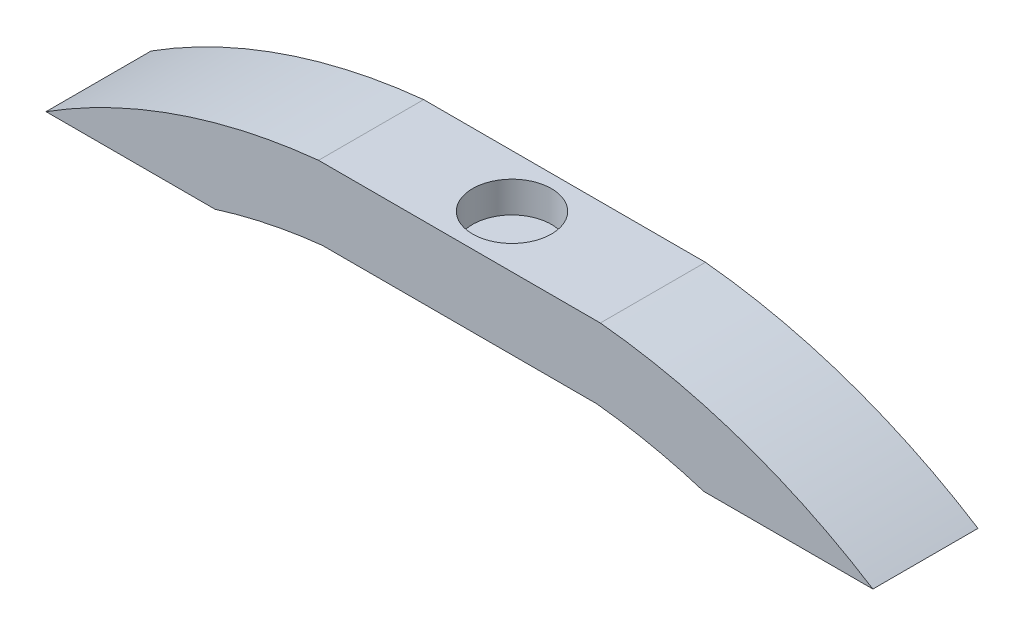
ISO-10303-21;
HEADER;
FILE_DESCRIPTION(('STEP AP214'),'2;1');
FILE_NAME('part.step','',(''),(''),'','','');
FILE_SCHEMA(('AUTOMOTIVE_DESIGN { 1 0 10303 214 1 1 1 1 }'));
ENDSEC;
DATA;
#1=APPLICATION_CONTEXT('core data for automotive mechanical design processes');
#2=APPLICATION_PROTOCOL_DEFINITION('international standard','automotive_design',2000,#1);
#3=PRODUCT_CONTEXT('',#1,'mechanical');
#4=PRODUCT('Part','Part','',(#3));
#5=PRODUCT_RELATED_PRODUCT_CATEGORY('part','',(#4));
#6=PRODUCT_DEFINITION_FORMATION('','',#4);
#7=PRODUCT_DEFINITION_CONTEXT('part definition',#1,'design');
#8=PRODUCT_DEFINITION('design','',#6,#7);
#9=PRODUCT_DEFINITION_SHAPE('','',#8);
#10=(LENGTH_UNIT() NAMED_UNIT(*) SI_UNIT(.MILLI.,.METRE.));
#11=(NAMED_UNIT(*) PLANE_ANGLE_UNIT() SI_UNIT($,.RADIAN.));
#12=(NAMED_UNIT(*) SI_UNIT($,.STERADIAN.) SOLID_ANGLE_UNIT());
#13=UNCERTAINTY_MEASURE_WITH_UNIT(LENGTH_MEASURE(1.E-05),#10,'distance_accuracy_value','');
#14=(GEOMETRIC_REPRESENTATION_CONTEXT(3) GLOBAL_UNCERTAINTY_ASSIGNED_CONTEXT((#13)) GLOBAL_UNIT_ASSIGNED_CONTEXT((#10,
#11,#12)) REPRESENTATION_CONTEXT('',''));
#15=CARTESIAN_POINT('',(0.,0.,0.));
#16=DIRECTION('',(0.,0.,1.));
#17=DIRECTION('',(1.,0.,0.));
#18=AXIS2_PLACEMENT_3D('',#15,#16,#17);
#19=CARTESIAN_POINT('',(-7.54766795887324,0.,10.16));
#20=DIRECTION('',(0.,0.,-1.));
#21=DIRECTION('',(-1.,0.,0.));
#22=AXIS2_PLACEMENT_3D('',#19,#20,#21);
#23=CYLINDRICAL_SURFACE('',#22,60.57);
#24=CARTESIAN_POINT('',(-7.54766795887324,0.,0.));
#25=DIRECTION('',(0.,0.,1.));
#26=DIRECTION('',(1.,0.,0.));
#27=AXIS2_PLACEMENT_3D('',#24,#25,#26);
#28=CIRCLE('',#27,60.57);
#29=CARTESIAN_POINT('',(-13.62,60.2648461674159,0.));
#30=VERTEX_POINT('',#29);
#31=CARTESIAN_POINT('',(-39.965,51.1648461674159,0.));
#32=VERTEX_POINT('',#31);
#33=EDGE_CURVE('E146',#30,#32,#28,.T.);
#34=ORIENTED_EDGE('',*,*,#33,.T.);
#35=DIRECTION('',(0.,0.,-1.));
#36=VECTOR('',#35,1.);
#37=CARTESIAN_POINT('',(-39.965,51.1648461674159,10.16));
#38=LINE('',#37,#36);
#39=CARTESIAN_POINT('',(-39.965,51.1648461674159,10.16));
#40=VERTEX_POINT('',#39);
#41=EDGE_CURVE('E11',#40,#32,#38,.T.);
#42=ORIENTED_EDGE('',*,*,#41,.F.);
#43=CARTESIAN_POINT('',(-7.54766795887324,0.,10.16));
#44=DIRECTION('',(0.,0.,1.));
#45=DIRECTION('',(1.,0.,0.));
#46=AXIS2_PLACEMENT_3D('',#43,#44,#45);
#47=CIRCLE('',#46,60.57);
#48=CARTESIAN_POINT('',(-13.62,60.2648461674159,10.16));
#49=VERTEX_POINT('',#48);
#50=EDGE_CURVE('E169',#49,#40,#47,.T.);
#51=ORIENTED_EDGE('',*,*,#50,.F.);
#52=DIRECTION('',(0.,0.,-1.));
#53=VECTOR('',#52,1.);
#54=CARTESIAN_POINT('',(-13.62,60.2648461674159,10.16));
#55=LINE('',#54,#53);
#56=EDGE_CURVE('E142',#49,#30,#55,.T.);
#57=ORIENTED_EDGE('',*,*,#56,.T.);
#58=EDGE_LOOP('',(#34,#42,#51,#57));
#59=FACE_BOUND('',#58,.T.);
#60=ADVANCED_FACE('F45',(#59),#23,.T.);
#61=CARTESIAN_POINT('',(-39.965,51.1648461674159,10.16));
#62=DIRECTION('',(0.,1.,0.));
#63=DIRECTION('',(0.,0.,1.));
#64=AXIS2_PLACEMENT_3D('',#61,#62,#63);
#65=PLANE('',#64);
#66=DIRECTION('',(1.,0.,0.));
#67=VECTOR('',#66,1.);
#68=CARTESIAN_POINT('',(-39.965,51.1648461674159,0.));
#69=LINE('',#68,#67);
#70=CARTESIAN_POINT('',(-23.6204840364828,51.1648461674159,0.));
#71=VERTEX_POINT('',#70);
#72=EDGE_CURVE('E150',#32,#71,#69,.T.);
#73=ORIENTED_EDGE('',*,*,#72,.T.);
#74=DIRECTION('',(0.,0.,-1.));
#75=VECTOR('',#74,1.);
#76=CARTESIAN_POINT('',(-23.6204840364828,51.1648461674159,10.16));
#77=LINE('',#76,#75);
#78=CARTESIAN_POINT('',(-23.6204840364828,51.1648461674159,10.16));
#79=VERTEX_POINT('',#78);
#80=EDGE_CURVE('E54',#79,#71,#77,.T.);
#81=ORIENTED_EDGE('',*,*,#80,.F.);
#82=DIRECTION('',(1.,0.,0.));
#83=VECTOR('',#82,1.);
#84=CARTESIAN_POINT('',(-39.965,51.1648461674159,10.16));
#85=LINE('',#84,#83);
#86=EDGE_CURVE('E105',#40,#79,#85,.T.);
#87=ORIENTED_EDGE('',*,*,#86,.F.);
#88=ORIENTED_EDGE('',*,*,#41,.T.);
#89=EDGE_LOOP('',(#73,#81,#87,#88));
#90=FACE_BOUND('',#89,.T.);
#91=ADVANCED_FACE('F241',(#90),#65,.F.);
#92=CARTESIAN_POINT('',(-7.54766795887324,0.,10.16));
#93=DIRECTION('',(0.,0.,-1.));
#94=DIRECTION('',(-1.,0.,0.));
#95=AXIS2_PLACEMENT_3D('',#92,#93,#94);
#96=CYLINDRICAL_SURFACE('',#95,53.63);
#97=CARTESIAN_POINT('',(-7.54766795887324,0.,0.));
#98=DIRECTION('',(0.,0.,-1.));
#99=DIRECTION('',(1.,0.,0.));
#100=AXIS2_PLACEMENT_3D('',#97,#98,#99);
#101=CIRCLE('',#100,53.63);
#102=CARTESIAN_POINT('',(-13.2606077643875,53.3248461674159,0.));
#103=VERTEX_POINT('',#102);
#104=EDGE_CURVE('E154',#71,#103,#101,.T.);
#105=ORIENTED_EDGE('',*,*,#104,.T.);
#106=DIRECTION('',(0.,0.,-1.));
#107=VECTOR('',#106,1.);
#108=CARTESIAN_POINT('',(-13.2606077643875,53.3248461674159,10.16));
#109=LINE('',#108,#107);
#110=CARTESIAN_POINT('',(-13.2606077643875,53.3248461674159,10.16));
#111=VERTEX_POINT('',#110);
#112=EDGE_CURVE('E180',#111,#103,#109,.T.);
#113=ORIENTED_EDGE('',*,*,#112,.F.);
#114=CARTESIAN_POINT('',(-7.54766795887324,0.,10.16));
#115=DIRECTION('',(0.,0.,-1.));
#116=DIRECTION('',(1.,0.,0.));
#117=AXIS2_PLACEMENT_3D('',#114,#115,#116);
#118=CIRCLE('',#117,53.63);
#119=EDGE_CURVE('E190',#79,#111,#118,.T.);
#120=ORIENTED_EDGE('',*,*,#119,.F.);
#121=ORIENTED_EDGE('',*,*,#80,.T.);
#122=EDGE_LOOP('',(#105,#113,#120,#121));
#123=FACE_BOUND('',#122,.T.);
#124=ADVANCED_FACE('F188',(#123),#96,.F.);
#125=CARTESIAN_POINT('',(-13.2606077643875,53.3248461674159,10.16));
#126=DIRECTION('',(0.,1.,0.));
#127=DIRECTION('',(0.,0.,1.));
#128=AXIS2_PLACEMENT_3D('',#125,#126,#127);
#129=PLANE('',#128);
#130=DIRECTION('',(1.,0.,0.));
#131=VECTOR('',#130,1.);
#132=CARTESIAN_POINT('',(-13.2606077643875,53.3248461674159,0.));
#133=LINE('',#132,#131);
#134=CARTESIAN_POINT('',(13.2606077643875,53.3248461674159,0.));
#135=VERTEX_POINT('',#134);
#136=EDGE_CURVE('E157',#103,#135,#133,.T.);
#137=ORIENTED_EDGE('',*,*,#136,.T.);
#138=DIRECTION('',(0.,0.,-1.));
#139=VECTOR('',#138,1.);
#140=CARTESIAN_POINT('',(13.2606077643875,53.3248461674159,10.16));
#141=LINE('',#140,#139);
#142=CARTESIAN_POINT('',(13.2606077643875,53.3248461674159,10.16));
#143=VERTEX_POINT('',#142);
#144=EDGE_CURVE('E176',#143,#135,#141,.T.);
#145=ORIENTED_EDGE('',*,*,#144,.F.);
#146=DIRECTION('',(1.,0.,0.));
#147=VECTOR('',#146,1.);
#148=CARTESIAN_POINT('',(-13.2606077643875,53.3248461674159,10.16));
#149=LINE('',#148,#147);
#150=EDGE_CURVE('E203',#111,#143,#149,.T.);
#151=ORIENTED_EDGE('',*,*,#150,.F.);
#152=ORIENTED_EDGE('',*,*,#112,.T.);
#153=EDGE_LOOP('',(#137,#145,#151,#152));
#154=FACE_BOUND('',#153,.T.);
#155=ADVANCED_FACE('F198',(#154),#129,.F.);
#156=CARTESIAN_POINT('',(7.54766795887324,0.,10.16));
#157=DIRECTION('',(0.,0.,-1.));
#158=DIRECTION('',(-1.,0.,0.));
#159=AXIS2_PLACEMENT_3D('',#156,#157,#158);
#160=CYLINDRICAL_SURFACE('',#159,53.63);
#161=CARTESIAN_POINT('',(7.54766795887324,0.,0.));
#162=DIRECTION('',(0.,0.,-1.));
#163=DIRECTION('',(1.,0.,0.));
#164=AXIS2_PLACEMENT_3D('',#161,#162,#163);
#165=CIRCLE('',#164,53.63);
#166=CARTESIAN_POINT('',(23.6204840364828,51.1648461674159,0.));
#167=VERTEX_POINT('',#166);
#168=EDGE_CURVE('E160',#135,#167,#165,.T.);
#169=ORIENTED_EDGE('',*,*,#168,.T.);
#170=DIRECTION('',(0.,0.,-1.));
#171=VECTOR('',#170,1.);
#172=CARTESIAN_POINT('',(23.6204840364828,51.1648461674159,10.16));
#173=LINE('',#172,#171);
#174=CARTESIAN_POINT('',(23.6204840364828,51.1648461674159,10.16));
#175=VERTEX_POINT('',#174);
#176=EDGE_CURVE('E135',#175,#167,#173,.T.);
#177=ORIENTED_EDGE('',*,*,#176,.F.);
#178=CARTESIAN_POINT('',(7.54766795887324,0.,10.16));
#179=DIRECTION('',(0.,0.,-1.));
#180=DIRECTION('',(1.,0.,0.));
#181=AXIS2_PLACEMENT_3D('',#178,#179,#180);
#182=CIRCLE('',#181,53.63);
#183=EDGE_CURVE('E124',#143,#175,#182,.T.);
#184=ORIENTED_EDGE('',*,*,#183,.F.);
#185=ORIENTED_EDGE('',*,*,#144,.T.);
#186=EDGE_LOOP('',(#169,#177,#184,#185));
#187=FACE_BOUND('',#186,.T.);
#188=ADVANCED_FACE('F201',(#187),#160,.F.);
#189=CARTESIAN_POINT('',(39.965,51.1648461674159,10.16));
#190=DIRECTION('',(0.,1.,0.));
#191=DIRECTION('',(0.,0.,1.));
#192=AXIS2_PLACEMENT_3D('',#189,#190,#191);
#193=PLANE('',#192);
#194=DIRECTION('',(1.,0.,0.));
#195=VECTOR('',#194,1.);
#196=CARTESIAN_POINT('',(39.965,51.1648461674159,0.));
#197=LINE('',#196,#195);
#198=CARTESIAN_POINT('',(39.965,51.1648461674159,0.));
#199=VERTEX_POINT('',#198);
#200=EDGE_CURVE('E133',#167,#199,#197,.T.);
#201=ORIENTED_EDGE('',*,*,#200,.T.);
#202=DIRECTION('',(0.,0.,-1.));
#203=VECTOR('',#202,1.);
#204=CARTESIAN_POINT('',(39.965,51.1648461674159,10.16));
#205=LINE('',#204,#203);
#206=CARTESIAN_POINT('',(39.965,51.1648461674159,10.16));
#207=VERTEX_POINT('',#206);
#208=EDGE_CURVE('E130',#207,#199,#205,.T.);
#209=ORIENTED_EDGE('',*,*,#208,.F.);
#210=DIRECTION('',(1.,0.,0.));
#211=VECTOR('',#210,1.);
#212=CARTESIAN_POINT('',(39.965,51.1648461674159,10.16));
#213=LINE('',#212,#211);
#214=EDGE_CURVE('E118',#175,#207,#213,.T.);
#215=ORIENTED_EDGE('',*,*,#214,.F.);
#216=ORIENTED_EDGE('',*,*,#176,.T.);
#217=EDGE_LOOP('',(#201,#209,#215,#216));
#218=FACE_BOUND('',#217,.T.);
#219=ADVANCED_FACE('F131',(#218),#193,.F.);
#220=CARTESIAN_POINT('',(7.54766795887324,0.,10.16));
#221=DIRECTION('',(0.,0.,-1.));
#222=DIRECTION('',(-1.,0.,0.));
#223=AXIS2_PLACEMENT_3D('',#220,#221,#222);
#224=CYLINDRICAL_SURFACE('',#223,60.57);
#225=CARTESIAN_POINT('',(7.54766795887324,0.,0.));
#226=DIRECTION('',(0.,0.,1.));
#227=DIRECTION('',(1.,0.,0.));
#228=AXIS2_PLACEMENT_3D('',#225,#226,#227);
#229=CIRCLE('',#228,60.57);
#230=CARTESIAN_POINT('',(13.62,60.2648461674159,0.));
#231=VERTEX_POINT('',#230);
#232=EDGE_CURVE('E91',#199,#231,#229,.T.);
#233=ORIENTED_EDGE('',*,*,#232,.T.);
#234=DIRECTION('',(0.,0.,-1.));
#235=VECTOR('',#234,1.);
#236=CARTESIAN_POINT('',(13.62,60.2648461674159,10.16));
#237=LINE('',#236,#235);
#238=CARTESIAN_POINT('',(13.62,60.2648461674159,10.16));
#239=VERTEX_POINT('',#238);
#240=EDGE_CURVE('E136',#239,#231,#237,.T.);
#241=ORIENTED_EDGE('',*,*,#240,.F.);
#242=CARTESIAN_POINT('',(7.54766795887324,0.,10.16));
#243=DIRECTION('',(0.,0.,1.));
#244=DIRECTION('',(1.,0.,0.));
#245=AXIS2_PLACEMENT_3D('',#242,#243,#244);
#246=CIRCLE('',#245,60.57);
#247=EDGE_CURVE('E122',#207,#239,#246,.T.);
#248=ORIENTED_EDGE('',*,*,#247,.F.);
#249=ORIENTED_EDGE('',*,*,#208,.T.);
#250=EDGE_LOOP('',(#233,#241,#248,#249));
#251=FACE_BOUND('',#250,.T.);
#252=ADVANCED_FACE('F138',(#251),#224,.T.);
#253=CARTESIAN_POINT('',(-13.62,60.2648461674159,10.16));
#254=DIRECTION('',(0.,-1.,0.));
#255=DIRECTION('',(0.,0.,-1.));
#256=AXIS2_PLACEMENT_3D('',#253,#254,#255);
#257=PLANE('',#256);
#258=CARTESIAN_POINT('',(0.,60.2648461674159,5.08));
#259=DIRECTION('',(0.,1.,0.));
#260=DIRECTION('',(0.,0.,1.));
#261=AXIS2_PLACEMENT_3D('',#258,#259,#260);
#262=CIRCLE('',#261,3.81);
#263=CARTESIAN_POINT('',(0.,60.2648461674159,8.89));
#264=VERTEX_POINT('',#263);
#265=EDGE_CURVE('E213',#264,#264,#262,.T.);
#266=ORIENTED_EDGE('',*,*,#265,.F.);
#267=EDGE_LOOP('',(#266));
#268=FACE_BOUND('',#267,.T.);
#269=DIRECTION('',(-1.,0.,0.));
#270=VECTOR('',#269,1.);
#271=CARTESIAN_POINT('',(-13.62,60.2648461674159,0.));
#272=LINE('',#271,#270);
#273=EDGE_CURVE('E97',#231,#30,#272,.T.);
#274=ORIENTED_EDGE('',*,*,#273,.T.);
#275=ORIENTED_EDGE('',*,*,#56,.F.);
#276=DIRECTION('',(-1.,0.,0.));
#277=VECTOR('',#276,1.);
#278=CARTESIAN_POINT('',(-13.62,60.2648461674159,10.16));
#279=LINE('',#278,#277);
#280=EDGE_CURVE('E62',#239,#49,#279,.T.);
#281=ORIENTED_EDGE('',*,*,#280,.F.);
#282=ORIENTED_EDGE('',*,*,#240,.T.);
#283=EDGE_LOOP('',(#274,#275,#281,#282));
#284=FACE_BOUND('',#283,.T.);
#285=ADVANCED_FACE('F229',(#268,#284),#257,.F.);
#286=CARTESIAN_POINT('',(-7.54766795887324,0.,10.16));
#287=DIRECTION('',(0.,0.,1.));
#288=DIRECTION('',(1.,0.,0.));
#289=AXIS2_PLACEMENT_3D('',#286,#287,#288);
#290=PLANE('',#289);
#291=ORIENTED_EDGE('',*,*,#50,.T.);
#292=ORIENTED_EDGE('',*,*,#86,.T.);
#293=ORIENTED_EDGE('',*,*,#119,.T.);
#294=ORIENTED_EDGE('',*,*,#150,.T.);
#295=ORIENTED_EDGE('',*,*,#183,.T.);
#296=ORIENTED_EDGE('',*,*,#214,.T.);
#297=ORIENTED_EDGE('',*,*,#247,.T.);
#298=ORIENTED_EDGE('',*,*,#280,.T.);
#299=EDGE_LOOP('',(#291,#292,#293,#294,#295,#296,#297,#298));
#300=FACE_BOUND('',#299,.T.);
#301=ADVANCED_FACE('F120',(#300),#290,.T.);
#302=CARTESIAN_POINT('',(-7.54766795887324,0.,0.));
#303=DIRECTION('',(0.,0.,1.));
#304=DIRECTION('',(1.,0.,0.));
#305=AXIS2_PLACEMENT_3D('',#302,#303,#304);
#306=PLANE('',#305);
#307=ORIENTED_EDGE('',*,*,#33,.F.);
#308=ORIENTED_EDGE('',*,*,#273,.F.);
#309=ORIENTED_EDGE('',*,*,#232,.F.);
#310=ORIENTED_EDGE('',*,*,#200,.F.);
#311=ORIENTED_EDGE('',*,*,#168,.F.);
#312=ORIENTED_EDGE('',*,*,#136,.F.);
#313=ORIENTED_EDGE('',*,*,#104,.F.);
#314=ORIENTED_EDGE('',*,*,#72,.F.);
#315=EDGE_LOOP('',(#307,#308,#309,#310,#311,#312,#313,#314));
#316=FACE_BOUND('',#315,.T.);
#317=ADVANCED_FACE('F194',(#316),#306,.F.);
#318=CARTESIAN_POINT('',(0.,57.2648461674159,5.08));
#319=DIRECTION('',(0.,1.,0.));
#320=DIRECTION('',(0.,0.,1.));
#321=AXIS2_PLACEMENT_3D('',#318,#319,#320);
#322=CYLINDRICAL_SURFACE('',#321,3.81);
#323=CARTESIAN_POINT('',(0.,57.2648461674159,5.08));
#324=DIRECTION('',(0.,1.,0.));
#325=DIRECTION('',(0.,0.,1.));
#326=AXIS2_PLACEMENT_3D('',#323,#324,#325);
#327=CIRCLE('',#326,3.81);
#328=CARTESIAN_POINT('',(0.,57.2648461674159,8.89));
#329=VERTEX_POINT('',#328);
#330=EDGE_CURVE('E151',#329,#329,#327,.T.);
#331=ORIENTED_EDGE('',*,*,#330,.F.);
#332=EDGE_LOOP('',(#331));
#333=FACE_BOUND('',#332,.T.);
#334=ORIENTED_EDGE('',*,*,#265,.T.);
#335=EDGE_LOOP('',(#334));
#336=FACE_BOUND('',#335,.T.);
#337=ADVANCED_FACE('F223',(#333,#336),#322,.F.);
#338=CARTESIAN_POINT('',(0.,57.2648461674159,5.08));
#339=DIRECTION('',(0.,1.,0.));
#340=DIRECTION('',(0.,0.,1.));
#341=AXIS2_PLACEMENT_3D('',#338,#339,#340);
#342=PLANE('',#341);
#343=ORIENTED_EDGE('',*,*,#330,.T.);
#344=EDGE_LOOP('',(#343));
#345=FACE_BOUND('',#344,.T.);
#346=ADVANCED_FACE('F221',(#345),#342,.T.);
#347=CLOSED_SHELL('',(#60,#91,#124,#155,#188,#219,#252,#285,#301,#317,#337,#346));
#348=MANIFOLD_SOLID_BREP('B2',#347);
#349=ADVANCED_BREP_SHAPE_REPRESENTATION('',(#18,#348),#14);
#350=SHAPE_DEFINITION_REPRESENTATION(#9,#349);
ENDSEC;
END-ISO-10303-21;
